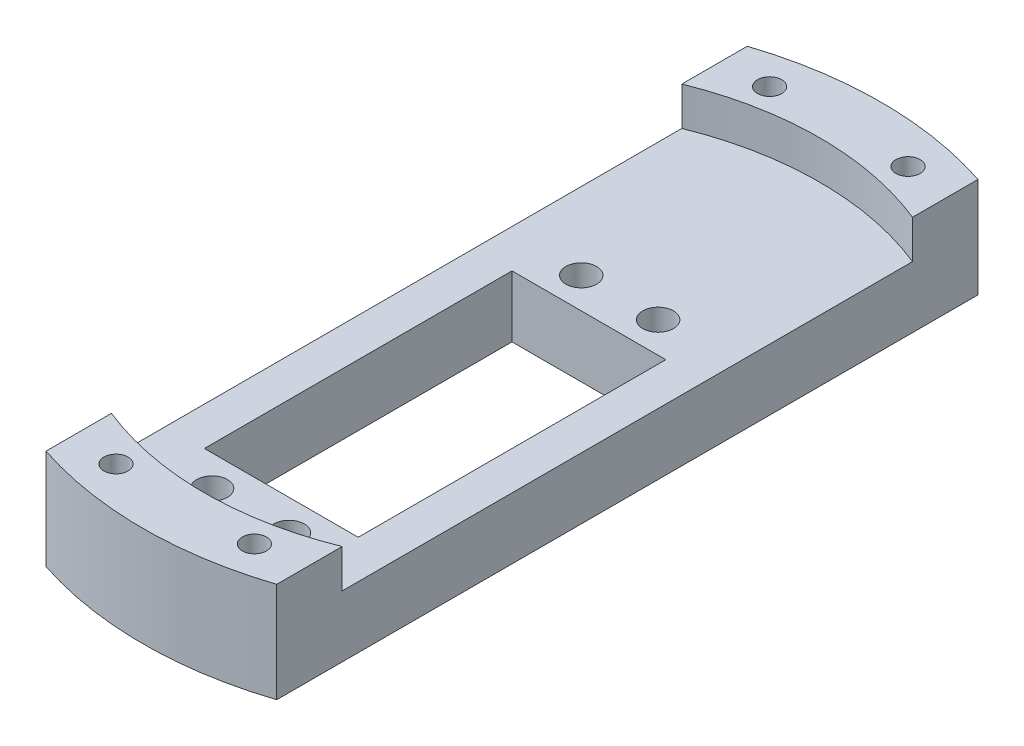
ISO-10303-21;
HEADER;
FILE_DESCRIPTION(('STEP AP214'),'2;1');
FILE_NAME('part.step','',(''),(''),'','','');
FILE_SCHEMA(('AUTOMOTIVE_DESIGN { 1 0 10303 214 1 1 1 1 }'));
ENDSEC;
DATA;
#1=APPLICATION_CONTEXT('core data for automotive mechanical design processes');
#2=APPLICATION_PROTOCOL_DEFINITION('international standard','automotive_design',2000,#1);
#3=PRODUCT_CONTEXT('',#1,'mechanical');
#4=PRODUCT('Part','Part','',(#3));
#5=PRODUCT_RELATED_PRODUCT_CATEGORY('part','',(#4));
#6=PRODUCT_DEFINITION_FORMATION('','',#4);
#7=PRODUCT_DEFINITION_CONTEXT('part definition',#1,'design');
#8=PRODUCT_DEFINITION('design','',#6,#7);
#9=PRODUCT_DEFINITION_SHAPE('','',#8);
#10=(LENGTH_UNIT() NAMED_UNIT(*) SI_UNIT(.MILLI.,.METRE.));
#11=(NAMED_UNIT(*) PLANE_ANGLE_UNIT() SI_UNIT($,.RADIAN.));
#12=(NAMED_UNIT(*) SI_UNIT($,.STERADIAN.) SOLID_ANGLE_UNIT());
#13=UNCERTAINTY_MEASURE_WITH_UNIT(LENGTH_MEASURE(1.E-05),#10,'distance_accuracy_value','');
#14=(GEOMETRIC_REPRESENTATION_CONTEXT(3) GLOBAL_UNCERTAINTY_ASSIGNED_CONTEXT((#13)) GLOBAL_UNIT_ASSIGNED_CONTEXT((#10,
#11,#12)) REPRESENTATION_CONTEXT('',''));
#15=CARTESIAN_POINT('',(0.,0.,0.));
#16=DIRECTION('',(0.,0.,1.));
#17=DIRECTION('',(1.,0.,0.));
#18=AXIS2_PLACEMENT_3D('',#15,#16,#17);
#19=CARTESIAN_POINT('',(0.,8.,0.));
#20=DIRECTION('',(0.,1.,0.));
#21=DIRECTION('',(0.,0.,1.));
#22=AXIS2_PLACEMENT_3D('',#19,#20,#21);
#23=PLANE('',#22);
#24=CARTESIAN_POINT('',(-5.,8.,-14.));
#25=DIRECTION('',(0.,1.,0.));
#26=DIRECTION('',(0.,0.,-1.));
#27=AXIS2_PLACEMENT_3D('',#24,#25,#26);
#28=CIRCLE('',#27,2.);
#29=CARTESIAN_POINT('',(-5.,8.,-16.));
#30=VERTEX_POINT('',#29);
#31=EDGE_CURVE('E170',#30,#30,#28,.T.);
#32=ORIENTED_EDGE('',*,*,#31,.F.);
#33=EDGE_LOOP('',(#32));
#34=FACE_BOUND('',#33,.T.);
#35=CARTESIAN_POINT('',(5.,8.,34.));
#36=DIRECTION('',(0.,1.,0.));
#37=DIRECTION('',(0.,0.,-1.));
#38=AXIS2_PLACEMENT_3D('',#35,#36,#37);
#39=CIRCLE('',#38,2.);
#40=CARTESIAN_POINT('',(5.,8.,32.));
#41=VERTEX_POINT('',#40);
#42=EDGE_CURVE('E182',#41,#41,#39,.T.);
#43=ORIENTED_EDGE('',*,*,#42,.F.);
#44=EDGE_LOOP('',(#43));
#45=FACE_BOUND('',#44,.T.);
#46=DIRECTION('',(-1.,0.,0.));
#47=VECTOR('',#46,1.);
#48=CARTESIAN_POINT('',(-10.,8.,-10.));
#49=LINE('',#48,#47);
#50=CARTESIAN_POINT('',(10.,8.,-10.));
#51=VERTEX_POINT('',#50);
#52=CARTESIAN_POINT('',(-10.,8.,-10.));
#53=VERTEX_POINT('',#52);
#54=EDGE_CURVE('E196',#51,#53,#49,.T.);
#55=ORIENTED_EDGE('',*,*,#54,.F.);
#56=DIRECTION('',(0.,0.,-1.));
#57=VECTOR('',#56,1.);
#58=CARTESIAN_POINT('',(10.,8.,30.));
#59=LINE('',#58,#57);
#60=CARTESIAN_POINT('',(10.,8.,30.));
#61=VERTEX_POINT('',#60);
#62=EDGE_CURVE('E194',#61,#51,#59,.T.);
#63=ORIENTED_EDGE('',*,*,#62,.F.);
#64=DIRECTION('',(1.,0.,0.));
#65=VECTOR('',#64,1.);
#66=CARTESIAN_POINT('',(-10.,8.,30.));
#67=LINE('',#66,#65);
#68=CARTESIAN_POINT('',(-10.,8.,30.));
#69=VERTEX_POINT('',#68);
#70=EDGE_CURVE('E202',#69,#61,#67,.T.);
#71=ORIENTED_EDGE('',*,*,#70,.F.);
#72=DIRECTION('',(0.,0.,1.));
#73=VECTOR('',#72,1.);
#74=CARTESIAN_POINT('',(-10.,8.,30.));
#75=LINE('',#74,#73);
#76=EDGE_CURVE('E199',#53,#69,#75,.T.);
#77=ORIENTED_EDGE('',*,*,#76,.F.);
#78=EDGE_LOOP('',(#55,#63,#71,#77));
#79=FACE_BOUND('',#78,.T.);
#80=CARTESIAN_POINT('',(-5.,8.,34.));
#81=DIRECTION('',(0.,1.,0.));
#82=DIRECTION('',(0.,0.,1.));
#83=AXIS2_PLACEMENT_3D('',#80,#81,#82);
#84=CIRCLE('',#83,2.);
#85=CARTESIAN_POINT('',(-5.,8.,36.));
#86=VERTEX_POINT('',#85);
#87=EDGE_CURVE('E188',#86,#86,#84,.T.);
#88=ORIENTED_EDGE('',*,*,#87,.F.);
#89=EDGE_LOOP('',(#88));
#90=FACE_BOUND('',#89,.T.);
#91=CARTESIAN_POINT('',(5.,8.,-14.));
#92=DIRECTION('',(0.,1.,0.));
#93=DIRECTION('',(0.,0.,1.));
#94=AXIS2_PLACEMENT_3D('',#91,#92,#93);
#95=CIRCLE('',#94,2.);
#96=CARTESIAN_POINT('',(5.,8.,-12.));
#97=VERTEX_POINT('',#96);
#98=EDGE_CURVE('E176',#97,#97,#95,.T.);
#99=ORIENTED_EDGE('',*,*,#98,.F.);
#100=EDGE_LOOP('',(#99));
#101=FACE_BOUND('',#100,.T.);
#102=DIRECTION('',(0.,0.,1.));
#103=VECTOR('',#102,1.);
#104=CARTESIAN_POINT('',(-15.,8.,45.596052460712));
#105=LINE('',#104,#103);
#106=CARTESIAN_POINT('',(-15.,8.,-37.0809924354783));
#107=VERTEX_POINT('',#106);
#108=CARTESIAN_POINT('',(-15.,8.,37.0809924354783));
#109=VERTEX_POINT('',#108);
#110=EDGE_CURVE('E55',#107,#109,#105,.T.);
#111=ORIENTED_EDGE('',*,*,#110,.T.);
#112=CARTESIAN_POINT('',(0.,8.,0.));
#113=DIRECTION('',(0.,-1.,0.));
#114=DIRECTION('',(0.,0.,1.));
#115=AXIS2_PLACEMENT_3D('',#112,#113,#114);
#116=CIRCLE('',#115,40.);
#117=CARTESIAN_POINT('',(15.,8.,37.0809924354783));
#118=VERTEX_POINT('',#117);
#119=EDGE_CURVE('E50',#118,#109,#116,.T.);
#120=ORIENTED_EDGE('',*,*,#119,.F.);
#121=DIRECTION('',(0.,0.,-1.));
#122=VECTOR('',#121,1.);
#123=CARTESIAN_POINT('',(15.,8.,45.596052460712));
#124=LINE('',#123,#122);
#125=CARTESIAN_POINT('',(15.,8.,-37.0809924354783));
#126=VERTEX_POINT('',#125);
#127=EDGE_CURVE('E225',#118,#126,#124,.T.);
#128=ORIENTED_EDGE('',*,*,#127,.T.);
#129=CARTESIAN_POINT('',(0.,8.,0.));
#130=DIRECTION('',(0.,-1.,0.));
#131=DIRECTION('',(0.,0.,1.));
#132=AXIS2_PLACEMENT_3D('',#129,#130,#131);
#133=CIRCLE('',#132,40.);
#134=EDGE_CURVE('E144',#107,#126,#133,.T.);
#135=ORIENTED_EDGE('',*,*,#134,.F.);
#136=EDGE_LOOP('',(#111,#120,#128,#135));
#137=FACE_BOUND('',#136,.T.);
#138=ADVANCED_FACE('F35',(#34,#45,#79,#90,#101,#137),#23,.T.);
#139=CARTESIAN_POINT('',(0.,0.,0.));
#140=DIRECTION('',(0.,1.,0.));
#141=DIRECTION('',(0.,0.,1.));
#142=AXIS2_PLACEMENT_3D('',#139,#140,#141);
#143=PLANE('',#142);
#144=CARTESIAN_POINT('',(9.00000000000001,0.,-42.5));
#145=DIRECTION('',(0.,1.,0.));
#146=DIRECTION('',(0.,0.,1.));
#147=AXIS2_PLACEMENT_3D('',#144,#145,#146);
#148=CIRCLE('',#147,1.575);
#149=CARTESIAN_POINT('',(9.00000000000001,0.,-40.925));
#150=VERTEX_POINT('',#149);
#151=EDGE_CURVE('E275',#150,#150,#148,.T.);
#152=ORIENTED_EDGE('',*,*,#151,.T.);
#153=EDGE_LOOP('',(#152));
#154=FACE_BOUND('',#153,.T.);
#155=CARTESIAN_POINT('',(9.00000000000001,0.,42.5));
#156=DIRECTION('',(0.,1.,0.));
#157=DIRECTION('',(0.,0.,1.));
#158=AXIS2_PLACEMENT_3D('',#155,#156,#157);
#159=CIRCLE('',#158,1.575);
#160=CARTESIAN_POINT('',(9.00000000000001,0.,44.075));
#161=VERTEX_POINT('',#160);
#162=EDGE_CURVE('E269',#161,#161,#159,.T.);
#163=ORIENTED_EDGE('',*,*,#162,.T.);
#164=EDGE_LOOP('',(#163));
#165=FACE_BOUND('',#164,.T.);
#166=CARTESIAN_POINT('',(-8.99999999999999,0.,-42.5));
#167=DIRECTION('',(0.,1.,0.));
#168=DIRECTION('',(0.,0.,1.));
#169=AXIS2_PLACEMENT_3D('',#166,#167,#168);
#170=CIRCLE('',#169,1.575);
#171=CARTESIAN_POINT('',(-8.99999999999999,0.,-40.925));
#172=VERTEX_POINT('',#171);
#173=EDGE_CURVE('E261',#172,#172,#170,.T.);
#174=ORIENTED_EDGE('',*,*,#173,.T.);
#175=EDGE_LOOP('',(#174));
#176=FACE_BOUND('',#175,.T.);
#177=CARTESIAN_POINT('',(-8.99999999999999,0.,42.5));
#178=DIRECTION('',(0.,1.,0.));
#179=DIRECTION('',(0.,0.,1.));
#180=AXIS2_PLACEMENT_3D('',#177,#178,#179);
#181=CIRCLE('',#180,1.575);
#182=CARTESIAN_POINT('',(-8.99999999999999,0.,44.075));
#183=VERTEX_POINT('',#182);
#184=EDGE_CURVE('E254',#183,#183,#181,.T.);
#185=ORIENTED_EDGE('',*,*,#184,.T.);
#186=EDGE_LOOP('',(#185));
#187=FACE_BOUND('',#186,.T.);
#188=CARTESIAN_POINT('',(0.,0.,0.));
#189=DIRECTION('',(0.,1.,0.));
#190=DIRECTION('',(0.,0.,1.));
#191=AXIS2_PLACEMENT_3D('',#188,#189,#190);
#192=CIRCLE('',#191,48.);
#193=CARTESIAN_POINT('',(-15.,0.,45.596052460712));
#194=VERTEX_POINT('',#193);
#195=CARTESIAN_POINT('',(15.,0.,45.596052460712));
#196=VERTEX_POINT('',#195);
#197=EDGE_CURVE('E224',#194,#196,#192,.T.);
#198=ORIENTED_EDGE('',*,*,#197,.F.);
#199=DIRECTION('',(0.,0.,1.));
#200=VECTOR('',#199,1.);
#201=CARTESIAN_POINT('',(-15.,0.,45.596052460712));
#202=LINE('',#201,#200);
#203=CARTESIAN_POINT('',(-15.,0.,-45.596052460712));
#204=VERTEX_POINT('',#203);
#205=EDGE_CURVE('E227',#204,#194,#202,.T.);
#206=ORIENTED_EDGE('',*,*,#205,.F.);
#207=CARTESIAN_POINT('',(0.,0.,0.));
#208=DIRECTION('',(0.,1.,0.));
#209=DIRECTION('',(0.,0.,1.));
#210=AXIS2_PLACEMENT_3D('',#207,#208,#209);
#211=CIRCLE('',#210,48.);
#212=CARTESIAN_POINT('',(15.,0.,-45.596052460712));
#213=VERTEX_POINT('',#212);
#214=EDGE_CURVE('E233',#213,#204,#211,.T.);
#215=ORIENTED_EDGE('',*,*,#214,.F.);
#216=DIRECTION('',(0.,0.,-1.));
#217=VECTOR('',#216,1.);
#218=CARTESIAN_POINT('',(15.,0.,45.596052460712));
#219=LINE('',#218,#217);
#220=EDGE_CURVE('E231',#196,#213,#219,.T.);
#221=ORIENTED_EDGE('',*,*,#220,.F.);
#222=EDGE_LOOP('',(#198,#206,#215,#221));
#223=FACE_BOUND('',#222,.T.);
#224=DIRECTION('',(0.,0.,-1.));
#225=VECTOR('',#224,1.);
#226=CARTESIAN_POINT('',(10.,0.,30.));
#227=LINE('',#226,#225);
#228=CARTESIAN_POINT('',(10.,0.,30.));
#229=VERTEX_POINT('',#228);
#230=CARTESIAN_POINT('',(10.,0.,-10.));
#231=VERTEX_POINT('',#230);
#232=EDGE_CURVE('E191',#229,#231,#227,.T.);
#233=ORIENTED_EDGE('',*,*,#232,.T.);
#234=DIRECTION('',(-1.,0.,0.));
#235=VECTOR('',#234,1.);
#236=CARTESIAN_POINT('',(-10.,0.,-10.));
#237=LINE('',#236,#235);
#238=CARTESIAN_POINT('',(-10.,0.,-10.));
#239=VERTEX_POINT('',#238);
#240=EDGE_CURVE('E207',#231,#239,#237,.T.);
#241=ORIENTED_EDGE('',*,*,#240,.T.);
#242=DIRECTION('',(0.,0.,1.));
#243=VECTOR('',#242,1.);
#244=CARTESIAN_POINT('',(-10.,0.,30.));
#245=LINE('',#244,#243);
#246=CARTESIAN_POINT('',(-10.,0.,30.));
#247=VERTEX_POINT('',#246);
#248=EDGE_CURVE('E210',#239,#247,#245,.T.);
#249=ORIENTED_EDGE('',*,*,#248,.T.);
#250=DIRECTION('',(1.,0.,0.));
#251=VECTOR('',#250,1.);
#252=CARTESIAN_POINT('',(-10.,0.,30.));
#253=LINE('',#252,#251);
#254=EDGE_CURVE('E197',#247,#229,#253,.T.);
#255=ORIENTED_EDGE('',*,*,#254,.T.);
#256=EDGE_LOOP('',(#233,#241,#249,#255));
#257=FACE_BOUND('',#256,.T.);
#258=CARTESIAN_POINT('',(-5.,0.,34.));
#259=DIRECTION('',(0.,1.,0.));
#260=DIRECTION('',(0.,0.,1.));
#261=AXIS2_PLACEMENT_3D('',#258,#259,#260);
#262=CIRCLE('',#261,2.);
#263=CARTESIAN_POINT('',(-5.,0.,36.));
#264=VERTEX_POINT('',#263);
#265=EDGE_CURVE('E185',#264,#264,#262,.T.);
#266=ORIENTED_EDGE('',*,*,#265,.T.);
#267=EDGE_LOOP('',(#266));
#268=FACE_BOUND('',#267,.T.);
#269=CARTESIAN_POINT('',(5.,0.,34.));
#270=DIRECTION('',(0.,1.,0.));
#271=DIRECTION('',(0.,0.,-1.));
#272=AXIS2_PLACEMENT_3D('',#269,#270,#271);
#273=CIRCLE('',#272,2.);
#274=CARTESIAN_POINT('',(5.,0.,32.));
#275=VERTEX_POINT('',#274);
#276=EDGE_CURVE('E179',#275,#275,#273,.T.);
#277=ORIENTED_EDGE('',*,*,#276,.T.);
#278=EDGE_LOOP('',(#277));
#279=FACE_BOUND('',#278,.T.);
#280=CARTESIAN_POINT('',(5.,0.,-14.));
#281=DIRECTION('',(0.,1.,0.));
#282=DIRECTION('',(0.,0.,1.));
#283=AXIS2_PLACEMENT_3D('',#280,#281,#282);
#284=CIRCLE('',#283,2.);
#285=CARTESIAN_POINT('',(5.,0.,-12.));
#286=VERTEX_POINT('',#285);
#287=EDGE_CURVE('E173',#286,#286,#284,.T.);
#288=ORIENTED_EDGE('',*,*,#287,.T.);
#289=EDGE_LOOP('',(#288));
#290=FACE_BOUND('',#289,.T.);
#291=CARTESIAN_POINT('',(-5.,0.,-14.));
#292=DIRECTION('',(0.,1.,0.));
#293=DIRECTION('',(0.,0.,-1.));
#294=AXIS2_PLACEMENT_3D('',#291,#292,#293);
#295=CIRCLE('',#294,2.);
#296=CARTESIAN_POINT('',(-5.,0.,-16.));
#297=VERTEX_POINT('',#296);
#298=EDGE_CURVE('E169',#297,#297,#295,.T.);
#299=ORIENTED_EDGE('',*,*,#298,.T.);
#300=EDGE_LOOP('',(#299));
#301=FACE_BOUND('',#300,.T.);
#302=ADVANCED_FACE('F248',(#154,#165,#176,#187,#223,#257,#268,#279,#290,#301),#143,.F.);
#303=CARTESIAN_POINT('',(0.,8.,0.));
#304=DIRECTION('',(0.,-1.,0.));
#305=DIRECTION('',(0.,0.,-1.));
#306=AXIS2_PLACEMENT_3D('',#303,#304,#305);
#307=CYLINDRICAL_SURFACE('',#306,48.);
#308=ORIENTED_EDGE('',*,*,#197,.T.);
#309=DIRECTION('',(0.,-1.,0.));
#310=VECTOR('',#309,1.);
#311=CARTESIAN_POINT('',(15.,8.,45.596052460712));
#312=LINE('',#311,#310);
#313=CARTESIAN_POINT('',(15.,13.,45.596052460712));
#314=VERTEX_POINT('',#313);
#315=EDGE_CURVE('E11',#314,#196,#312,.T.);
#316=ORIENTED_EDGE('',*,*,#315,.F.);
#317=CARTESIAN_POINT('',(0.,13.,0.));
#318=DIRECTION('',(0.,1.,0.));
#319=DIRECTION('',(0.,0.,1.));
#320=AXIS2_PLACEMENT_3D('',#317,#318,#319);
#321=CIRCLE('',#320,48.);
#322=CARTESIAN_POINT('',(-15.,13.,45.596052460712));
#323=VERTEX_POINT('',#322);
#324=EDGE_CURVE('E132',#323,#314,#321,.T.);
#325=ORIENTED_EDGE('',*,*,#324,.F.);
#326=DIRECTION('',(0.,-1.,0.));
#327=VECTOR('',#326,1.);
#328=CARTESIAN_POINT('',(-15.,8.,45.596052460712));
#329=LINE('',#328,#327);
#330=EDGE_CURVE('E128',#323,#194,#329,.T.);
#331=ORIENTED_EDGE('',*,*,#330,.T.);
#332=EDGE_LOOP('',(#308,#316,#325,#331));
#333=FACE_BOUND('',#332,.T.);
#334=ADVANCED_FACE('F37',(#333),#307,.T.);
#335=CARTESIAN_POINT('',(15.,8.,45.596052460712));
#336=DIRECTION('',(-1.,0.,0.));
#337=DIRECTION('',(0.,0.,1.));
#338=AXIS2_PLACEMENT_3D('',#335,#336,#337);
#339=PLANE('',#338);
#340=ORIENTED_EDGE('',*,*,#220,.T.);
#341=DIRECTION('',(0.,-1.,0.));
#342=VECTOR('',#341,1.);
#343=CARTESIAN_POINT('',(15.,8.,-45.596052460712));
#344=LINE('',#343,#342);
#345=CARTESIAN_POINT('',(15.,13.,-45.596052460712));
#346=VERTEX_POINT('',#345);
#347=EDGE_CURVE('E43',#346,#213,#344,.T.);
#348=ORIENTED_EDGE('',*,*,#347,.F.);
#349=DIRECTION('',(0.,0.,-1.));
#350=VECTOR('',#349,1.);
#351=CARTESIAN_POINT('',(15.,13.,-45.596052460712));
#352=LINE('',#351,#350);
#353=CARTESIAN_POINT('',(15.,13.,-37.0809924354783));
#354=VERTEX_POINT('',#353);
#355=EDGE_CURVE('E155',#354,#346,#352,.T.);
#356=ORIENTED_EDGE('',*,*,#355,.F.);
#357=DIRECTION('',(0.,-1.,0.));
#358=VECTOR('',#357,1.);
#359=CARTESIAN_POINT('',(15.,13.,-37.0809924354783));
#360=LINE('',#359,#358);
#361=EDGE_CURVE('E166',#354,#126,#360,.T.);
#362=ORIENTED_EDGE('',*,*,#361,.T.);
#363=ORIENTED_EDGE('',*,*,#127,.F.);
#364=DIRECTION('',(0.,-1.,0.));
#365=VECTOR('',#364,1.);
#366=CARTESIAN_POINT('',(15.,13.,37.0809924354783));
#367=LINE('',#366,#365);
#368=CARTESIAN_POINT('',(15.,13.,37.0809924354783));
#369=VERTEX_POINT('',#368);
#370=EDGE_CURVE('E145',#369,#118,#367,.T.);
#371=ORIENTED_EDGE('',*,*,#370,.F.);
#372=DIRECTION('',(0.,0.,-1.));
#373=VECTOR('',#372,1.);
#374=CARTESIAN_POINT('',(15.,13.,37.0809924354783));
#375=LINE('',#374,#373);
#376=EDGE_CURVE('E138',#314,#369,#375,.T.);
#377=ORIENTED_EDGE('',*,*,#376,.F.);
#378=ORIENTED_EDGE('',*,*,#315,.T.);
#379=EDGE_LOOP('',(#340,#348,#356,#362,#363,#371,#377,#378));
#380=FACE_BOUND('',#379,.T.);
#381=ADVANCED_FACE('F295',(#380),#339,.F.);
#382=CARTESIAN_POINT('',(0.,8.,0.));
#383=DIRECTION('',(0.,-1.,0.));
#384=DIRECTION('',(0.,0.,-1.));
#385=AXIS2_PLACEMENT_3D('',#382,#383,#384);
#386=CYLINDRICAL_SURFACE('',#385,48.);
#387=ORIENTED_EDGE('',*,*,#214,.T.);
#388=DIRECTION('',(0.,-1.,0.));
#389=VECTOR('',#388,1.);
#390=CARTESIAN_POINT('',(-15.,8.,-45.596052460712));
#391=LINE('',#390,#389);
#392=CARTESIAN_POINT('',(-15.,13.,-45.596052460712));
#393=VERTEX_POINT('',#392);
#394=EDGE_CURVE('E237',#393,#204,#391,.T.);
#395=ORIENTED_EDGE('',*,*,#394,.F.);
#396=CARTESIAN_POINT('',(0.,13.,0.));
#397=DIRECTION('',(0.,1.,0.));
#398=DIRECTION('',(0.,0.,1.));
#399=AXIS2_PLACEMENT_3D('',#396,#397,#398);
#400=CIRCLE('',#399,48.);
#401=EDGE_CURVE('E158',#346,#393,#400,.T.);
#402=ORIENTED_EDGE('',*,*,#401,.F.);
#403=ORIENTED_EDGE('',*,*,#347,.T.);
#404=EDGE_LOOP('',(#387,#395,#402,#403));
#405=FACE_BOUND('',#404,.T.);
#406=ADVANCED_FACE('F243',(#405),#386,.T.);
#407=CARTESIAN_POINT('',(-15.,8.,45.596052460712));
#408=DIRECTION('',(1.,0.,0.));
#409=DIRECTION('',(0.,0.,-1.));
#410=AXIS2_PLACEMENT_3D('',#407,#408,#409);
#411=PLANE('',#410);
#412=ORIENTED_EDGE('',*,*,#205,.T.);
#413=ORIENTED_EDGE('',*,*,#330,.F.);
#414=DIRECTION('',(0.,0.,1.));
#415=VECTOR('',#414,1.);
#416=CARTESIAN_POINT('',(-15.,13.,37.0809924354783));
#417=LINE('',#416,#415);
#418=CARTESIAN_POINT('',(-15.,13.,37.0809924354783));
#419=VERTEX_POINT('',#418);
#420=EDGE_CURVE('E122',#419,#323,#417,.T.);
#421=ORIENTED_EDGE('',*,*,#420,.F.);
#422=DIRECTION('',(0.,-1.,0.));
#423=VECTOR('',#422,1.);
#424=CARTESIAN_POINT('',(-15.,13.,37.0809924354783));
#425=LINE('',#424,#423);
#426=EDGE_CURVE('E126',#419,#109,#425,.T.);
#427=ORIENTED_EDGE('',*,*,#426,.T.);
#428=ORIENTED_EDGE('',*,*,#110,.F.);
#429=DIRECTION('',(0.,-1.,0.));
#430=VECTOR('',#429,1.);
#431=CARTESIAN_POINT('',(-15.,13.,-37.0809924354783));
#432=LINE('',#431,#430);
#433=CARTESIAN_POINT('',(-15.,13.,-37.0809924354783));
#434=VERTEX_POINT('',#433);
#435=EDGE_CURVE('E162',#434,#107,#432,.T.);
#436=ORIENTED_EDGE('',*,*,#435,.F.);
#437=DIRECTION('',(0.,0.,1.));
#438=VECTOR('',#437,1.);
#439=CARTESIAN_POINT('',(-15.,13.,-37.0809924354783));
#440=LINE('',#439,#438);
#441=EDGE_CURVE('E161',#393,#434,#440,.T.);
#442=ORIENTED_EDGE('',*,*,#441,.F.);
#443=ORIENTED_EDGE('',*,*,#394,.T.);
#444=EDGE_LOOP('',(#412,#413,#421,#427,#428,#436,#442,#443));
#445=FACE_BOUND('',#444,.T.);
#446=ADVANCED_FACE('F124',(#445),#411,.F.);
#447=CARTESIAN_POINT('',(10.,8.,30.));
#448=DIRECTION('',(-1.,0.,0.));
#449=DIRECTION('',(0.,0.,1.));
#450=AXIS2_PLACEMENT_3D('',#447,#448,#449);
#451=PLANE('',#450);
#452=ORIENTED_EDGE('',*,*,#232,.F.);
#453=DIRECTION('',(0.,-1.,0.));
#454=VECTOR('',#453,1.);
#455=CARTESIAN_POINT('',(10.,8.,30.));
#456=LINE('',#455,#454);
#457=EDGE_CURVE('E204',#61,#229,#456,.T.);
#458=ORIENTED_EDGE('',*,*,#457,.F.);
#459=ORIENTED_EDGE('',*,*,#62,.T.);
#460=DIRECTION('',(0.,-1.,0.));
#461=VECTOR('',#460,1.);
#462=CARTESIAN_POINT('',(10.,8.,-10.));
#463=LINE('',#462,#461);
#464=EDGE_CURVE('E221',#51,#231,#463,.T.);
#465=ORIENTED_EDGE('',*,*,#464,.T.);
#466=EDGE_LOOP('',(#452,#458,#459,#465));
#467=FACE_BOUND('',#466,.T.);
#468=ADVANCED_FACE('F307',(#467),#451,.T.);
#469=CARTESIAN_POINT('',(-10.,8.,-10.));
#470=DIRECTION('',(0.,0.,1.));
#471=DIRECTION('',(1.,0.,0.));
#472=AXIS2_PLACEMENT_3D('',#469,#470,#471);
#473=PLANE('',#472);
#474=ORIENTED_EDGE('',*,*,#240,.F.);
#475=ORIENTED_EDGE('',*,*,#464,.F.);
#476=ORIENTED_EDGE('',*,*,#54,.T.);
#477=DIRECTION('',(0.,-1.,0.));
#478=VECTOR('',#477,1.);
#479=CARTESIAN_POINT('',(-10.,8.,-10.));
#480=LINE('',#479,#478);
#481=EDGE_CURVE('E219',#53,#239,#480,.T.);
#482=ORIENTED_EDGE('',*,*,#481,.T.);
#483=EDGE_LOOP('',(#474,#475,#476,#482));
#484=FACE_BOUND('',#483,.T.);
#485=ADVANCED_FACE('F410',(#484),#473,.T.);
#486=CARTESIAN_POINT('',(-10.,8.,30.));
#487=DIRECTION('',(1.,0.,0.));
#488=DIRECTION('',(0.,0.,-1.));
#489=AXIS2_PLACEMENT_3D('',#486,#487,#488);
#490=PLANE('',#489);
#491=ORIENTED_EDGE('',*,*,#248,.F.);
#492=ORIENTED_EDGE('',*,*,#481,.F.);
#493=ORIENTED_EDGE('',*,*,#76,.T.);
#494=DIRECTION('',(0.,-1.,0.));
#495=VECTOR('',#494,1.);
#496=CARTESIAN_POINT('',(-10.,8.,30.));
#497=LINE('',#496,#495);
#498=EDGE_CURVE('E217',#69,#247,#497,.T.);
#499=ORIENTED_EDGE('',*,*,#498,.T.);
#500=EDGE_LOOP('',(#491,#492,#493,#499));
#501=FACE_BOUND('',#500,.T.);
#502=ADVANCED_FACE('F407',(#501),#490,.T.);
#503=CARTESIAN_POINT('',(-10.,8.,30.));
#504=DIRECTION('',(0.,0.,-1.));
#505=DIRECTION('',(-1.,0.,0.));
#506=AXIS2_PLACEMENT_3D('',#503,#504,#505);
#507=PLANE('',#506);
#508=ORIENTED_EDGE('',*,*,#254,.F.);
#509=ORIENTED_EDGE('',*,*,#498,.F.);
#510=ORIENTED_EDGE('',*,*,#70,.T.);
#511=ORIENTED_EDGE('',*,*,#457,.T.);
#512=EDGE_LOOP('',(#508,#509,#510,#511));
#513=FACE_BOUND('',#512,.T.);
#514=ADVANCED_FACE('F403',(#513),#507,.T.);
#515=CARTESIAN_POINT('',(-5.,8.,34.));
#516=DIRECTION('',(0.,-1.,0.));
#517=DIRECTION('',(0.,0.,-1.));
#518=AXIS2_PLACEMENT_3D('',#515,#516,#517);
#519=CYLINDRICAL_SURFACE('',#518,2.);
#520=ORIENTED_EDGE('',*,*,#87,.T.);
#521=EDGE_LOOP('',(#520));
#522=FACE_BOUND('',#521,.T.);
#523=ORIENTED_EDGE('',*,*,#265,.F.);
#524=EDGE_LOOP('',(#523));
#525=FACE_BOUND('',#524,.T.);
#526=ADVANCED_FACE('F399',(#522,#525),#519,.F.);
#527=CARTESIAN_POINT('',(5.,8.,34.));
#528=DIRECTION('',(0.,-1.,0.));
#529=DIRECTION('',(0.,0.,-1.));
#530=AXIS2_PLACEMENT_3D('',#527,#528,#529);
#531=CYLINDRICAL_SURFACE('',#530,2.);
#532=ORIENTED_EDGE('',*,*,#42,.T.);
#533=EDGE_LOOP('',(#532));
#534=FACE_BOUND('',#533,.T.);
#535=ORIENTED_EDGE('',*,*,#276,.F.);
#536=EDGE_LOOP('',(#535));
#537=FACE_BOUND('',#536,.T.);
#538=ADVANCED_FACE('F395',(#534,#537),#531,.F.);
#539=CARTESIAN_POINT('',(5.,8.,-14.));
#540=DIRECTION('',(0.,-1.,0.));
#541=DIRECTION('',(0.,0.,-1.));
#542=AXIS2_PLACEMENT_3D('',#539,#540,#541);
#543=CYLINDRICAL_SURFACE('',#542,2.);
#544=ORIENTED_EDGE('',*,*,#98,.T.);
#545=EDGE_LOOP('',(#544));
#546=FACE_BOUND('',#545,.T.);
#547=ORIENTED_EDGE('',*,*,#287,.F.);
#548=EDGE_LOOP('',(#547));
#549=FACE_BOUND('',#548,.T.);
#550=ADVANCED_FACE('F391',(#546,#549),#543,.F.);
#551=CARTESIAN_POINT('',(-5.,8.,-14.));
#552=DIRECTION('',(0.,-1.,0.));
#553=DIRECTION('',(0.,0.,-1.));
#554=AXIS2_PLACEMENT_3D('',#551,#552,#553);
#555=CYLINDRICAL_SURFACE('',#554,2.);
#556=ORIENTED_EDGE('',*,*,#31,.T.);
#557=EDGE_LOOP('',(#556));
#558=FACE_BOUND('',#557,.T.);
#559=ORIENTED_EDGE('',*,*,#298,.F.);
#560=EDGE_LOOP('',(#559));
#561=FACE_BOUND('',#560,.T.);
#562=ADVANCED_FACE('F388',(#558,#561),#555,.F.);
#563=CARTESIAN_POINT('',(0.,13.,0.));
#564=DIRECTION('',(0.,-1.,0.));
#565=DIRECTION('',(0.,0.,-1.));
#566=AXIS2_PLACEMENT_3D('',#563,#564,#565);
#567=CYLINDRICAL_SURFACE('',#566,40.);
#568=ORIENTED_EDGE('',*,*,#134,.T.);
#569=ORIENTED_EDGE('',*,*,#361,.F.);
#570=CARTESIAN_POINT('',(0.,13.,0.));
#571=DIRECTION('',(0.,-1.,0.));
#572=DIRECTION('',(0.,0.,1.));
#573=AXIS2_PLACEMENT_3D('',#570,#571,#572);
#574=CIRCLE('',#573,40.);
#575=EDGE_CURVE('E148',#434,#354,#574,.T.);
#576=ORIENTED_EDGE('',*,*,#575,.F.);
#577=ORIENTED_EDGE('',*,*,#435,.T.);
#578=EDGE_LOOP('',(#568,#569,#576,#577));
#579=FACE_BOUND('',#578,.T.);
#580=ADVANCED_FACE('F287',(#579),#567,.F.);
#581=CARTESIAN_POINT('',(0.,13.,0.));
#582=DIRECTION('',(0.,1.,0.));
#583=DIRECTION('',(0.,0.,1.));
#584=AXIS2_PLACEMENT_3D('',#581,#582,#583);
#585=PLANE('',#584);
#586=CARTESIAN_POINT('',(9.00000000000001,13.,-42.5));
#587=DIRECTION('',(0.,1.,0.));
#588=DIRECTION('',(0.,0.,1.));
#589=AXIS2_PLACEMENT_3D('',#586,#587,#588);
#590=CIRCLE('',#589,1.57499999999999);
#591=CARTESIAN_POINT('',(9.00000000000001,13.,-40.925));
#592=VERTEX_POINT('',#591);
#593=EDGE_CURVE('E278',#592,#592,#590,.T.);
#594=ORIENTED_EDGE('',*,*,#593,.F.);
#595=EDGE_LOOP('',(#594));
#596=FACE_BOUND('',#595,.T.);
#597=CARTESIAN_POINT('',(-8.99999999999999,13.,-42.5));
#598=DIRECTION('',(0.,1.,0.));
#599=DIRECTION('',(0.,0.,1.));
#600=AXIS2_PLACEMENT_3D('',#597,#598,#599);
#601=CIRCLE('',#600,1.57499999999999);
#602=CARTESIAN_POINT('',(-8.99999999999999,13.,-40.925));
#603=VERTEX_POINT('',#602);
#604=EDGE_CURVE('E266',#603,#603,#601,.T.);
#605=ORIENTED_EDGE('',*,*,#604,.F.);
#606=EDGE_LOOP('',(#605));
#607=FACE_BOUND('',#606,.T.);
#608=ORIENTED_EDGE('',*,*,#575,.T.);
#609=ORIENTED_EDGE('',*,*,#355,.T.);
#610=ORIENTED_EDGE('',*,*,#401,.T.);
#611=ORIENTED_EDGE('',*,*,#441,.T.);
#612=EDGE_LOOP('',(#608,#609,#610,#611));
#613=FACE_BOUND('',#612,.T.);
#614=ADVANCED_FACE('F284',(#596,#607,#613),#585,.T.);
#615=CARTESIAN_POINT('',(0.,13.,0.));
#616=DIRECTION('',(0.,-1.,0.));
#617=DIRECTION('',(0.,0.,-1.));
#618=AXIS2_PLACEMENT_3D('',#615,#616,#617);
#619=CYLINDRICAL_SURFACE('',#618,40.);
#620=ORIENTED_EDGE('',*,*,#119,.T.);
#621=ORIENTED_EDGE('',*,*,#426,.F.);
#622=CARTESIAN_POINT('',(0.,13.,0.));
#623=DIRECTION('',(0.,-1.,0.));
#624=DIRECTION('',(0.,0.,1.));
#625=AXIS2_PLACEMENT_3D('',#622,#623,#624);
#626=CIRCLE('',#625,40.);
#627=EDGE_CURVE('E133',#369,#419,#626,.T.);
#628=ORIENTED_EDGE('',*,*,#627,.F.);
#629=ORIENTED_EDGE('',*,*,#370,.T.);
#630=EDGE_LOOP('',(#620,#621,#628,#629));
#631=FACE_BOUND('',#630,.T.);
#632=ADVANCED_FACE('F143',(#631),#619,.F.);
#633=CARTESIAN_POINT('',(0.,13.,0.));
#634=DIRECTION('',(0.,1.,0.));
#635=DIRECTION('',(0.,0.,1.));
#636=AXIS2_PLACEMENT_3D('',#633,#634,#635);
#637=PLANE('',#636);
#638=CARTESIAN_POINT('',(9.00000000000001,13.,42.5));
#639=DIRECTION('',(0.,1.,0.));
#640=DIRECTION('',(0.,0.,1.));
#641=AXIS2_PLACEMENT_3D('',#638,#639,#640);
#642=CIRCLE('',#641,1.57499999999999);
#643=CARTESIAN_POINT('',(9.00000000000001,13.,44.075));
#644=VERTEX_POINT('',#643);
#645=EDGE_CURVE('E272',#644,#644,#642,.T.);
#646=ORIENTED_EDGE('',*,*,#645,.F.);
#647=EDGE_LOOP('',(#646));
#648=FACE_BOUND('',#647,.T.);
#649=CARTESIAN_POINT('',(-8.99999999999999,13.,42.5));
#650=DIRECTION('',(0.,1.,0.));
#651=DIRECTION('',(0.,0.,1.));
#652=AXIS2_PLACEMENT_3D('',#649,#650,#651);
#653=CIRCLE('',#652,1.57499999999999);
#654=CARTESIAN_POINT('',(-8.99999999999999,13.,44.075));
#655=VERTEX_POINT('',#654);
#656=EDGE_CURVE('E256',#655,#655,#653,.T.);
#657=ORIENTED_EDGE('',*,*,#656,.F.);
#658=EDGE_LOOP('',(#657));
#659=FACE_BOUND('',#658,.T.);
#660=ORIENTED_EDGE('',*,*,#627,.T.);
#661=ORIENTED_EDGE('',*,*,#420,.T.);
#662=ORIENTED_EDGE('',*,*,#324,.T.);
#663=ORIENTED_EDGE('',*,*,#376,.T.);
#664=EDGE_LOOP('',(#660,#661,#662,#663));
#665=FACE_BOUND('',#664,.T.);
#666=ADVANCED_FACE('F136',(#648,#659,#665),#637,.T.);
#667=CARTESIAN_POINT('',(-8.99999999999999,13.,42.5));
#668=DIRECTION('',(0.,1.,0.));
#669=DIRECTION('',(0.,0.,1.));
#670=AXIS2_PLACEMENT_3D('',#667,#668,#669);
#671=CYLINDRICAL_SURFACE('',#670,1.57499999999999);
#672=ORIENTED_EDGE('',*,*,#184,.F.);
#673=EDGE_LOOP('',(#672));
#674=FACE_BOUND('',#673,.T.);
#675=ORIENTED_EDGE('',*,*,#656,.T.);
#676=EDGE_LOOP('',(#675));
#677=FACE_BOUND('',#676,.T.);
#678=ADVANCED_FACE('F330',(#674,#677),#671,.F.);
#679=CARTESIAN_POINT('',(-8.99999999999999,13.,-42.5));
#680=DIRECTION('',(0.,1.,0.));
#681=DIRECTION('',(0.,0.,1.));
#682=AXIS2_PLACEMENT_3D('',#679,#680,#681);
#683=CYLINDRICAL_SURFACE('',#682,1.57499999999999);
#684=ORIENTED_EDGE('',*,*,#173,.F.);
#685=EDGE_LOOP('',(#684));
#686=FACE_BOUND('',#685,.T.);
#687=ORIENTED_EDGE('',*,*,#604,.T.);
#688=EDGE_LOOP('',(#687));
#689=FACE_BOUND('',#688,.T.);
#690=ADVANCED_FACE('F354',(#686,#689),#683,.F.);
#691=CARTESIAN_POINT('',(9.00000000000001,13.,42.5));
#692=DIRECTION('',(0.,1.,0.));
#693=DIRECTION('',(0.,0.,1.));
#694=AXIS2_PLACEMENT_3D('',#691,#692,#693);
#695=CYLINDRICAL_SURFACE('',#694,1.57499999999999);
#696=ORIENTED_EDGE('',*,*,#162,.F.);
#697=EDGE_LOOP('',(#696));
#698=FACE_BOUND('',#697,.T.);
#699=ORIENTED_EDGE('',*,*,#645,.T.);
#700=EDGE_LOOP('',(#699));
#701=FACE_BOUND('',#700,.T.);
#702=ADVANCED_FACE('F359',(#698,#701),#695,.F.);
#703=CARTESIAN_POINT('',(9.00000000000001,13.,-42.5));
#704=DIRECTION('',(0.,1.,0.));
#705=DIRECTION('',(0.,0.,1.));
#706=AXIS2_PLACEMENT_3D('',#703,#704,#705);
#707=CYLINDRICAL_SURFACE('',#706,1.57499999999999);
#708=ORIENTED_EDGE('',*,*,#151,.F.);
#709=EDGE_LOOP('',(#708));
#710=FACE_BOUND('',#709,.T.);
#711=ORIENTED_EDGE('',*,*,#593,.T.);
#712=EDGE_LOOP('',(#711));
#713=FACE_BOUND('',#712,.T.);
#714=ADVANCED_FACE('F282',(#710,#713),#707,.F.);
#715=CLOSED_SHELL('',(#138,#302,#334,#381,#406,#446,#468,#485,#502,#514,#526,#538,#550,#562,
#580,#614,#632,#666,#678,#690,#702,#714));
#716=MANIFOLD_SOLID_BREP('B2',#715);
#717=ADVANCED_BREP_SHAPE_REPRESENTATION('',(#18,#716),#14);
#718=SHAPE_DEFINITION_REPRESENTATION(#9,#717);
ENDSEC;
END-ISO-10303-21;
